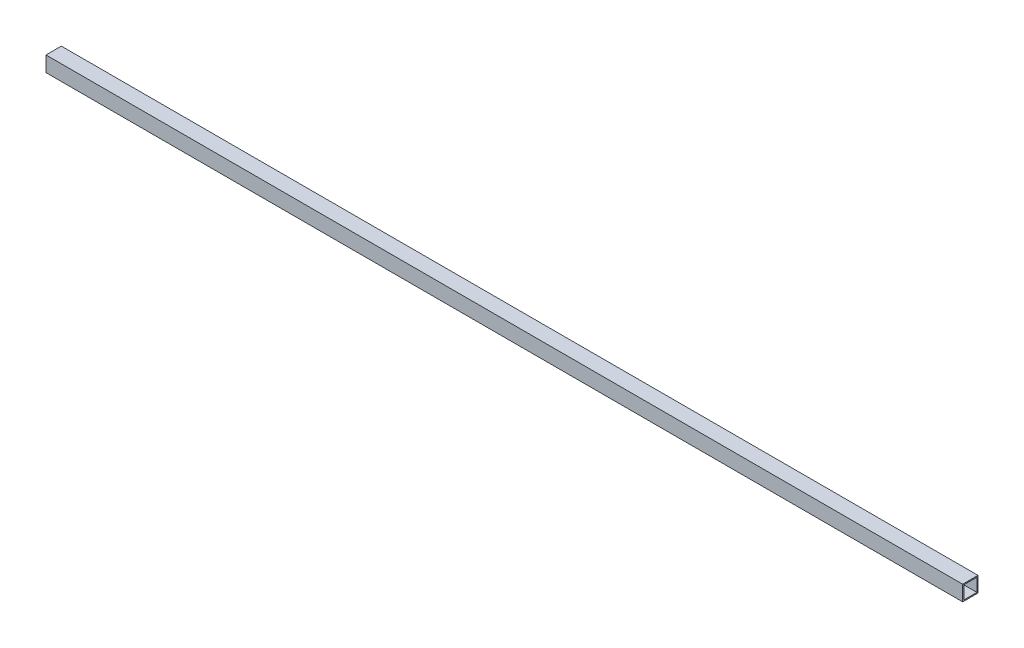
ISO-10303-21;
HEADER;
FILE_DESCRIPTION(('STEP AP214'),'2;1');
FILE_NAME('part.step','',(''),(''),'','','');
FILE_SCHEMA(('AUTOMOTIVE_DESIGN { 1 0 10303 214 1 1 1 1 }'));
ENDSEC;
DATA;
#1=APPLICATION_CONTEXT('core data for automotive mechanical design processes');
#2=APPLICATION_PROTOCOL_DEFINITION('international standard','automotive_design',2000,#1);
#3=PRODUCT_CONTEXT('',#1,'mechanical');
#4=PRODUCT('Part','Part','',(#3));
#5=PRODUCT_RELATED_PRODUCT_CATEGORY('part','',(#4));
#6=PRODUCT_DEFINITION_FORMATION('','',#4);
#7=PRODUCT_DEFINITION_CONTEXT('part definition',#1,'design');
#8=PRODUCT_DEFINITION('design','',#6,#7);
#9=PRODUCT_DEFINITION_SHAPE('','',#8);
#10=(LENGTH_UNIT() NAMED_UNIT(*) SI_UNIT(.MILLI.,.METRE.));
#11=(NAMED_UNIT(*) PLANE_ANGLE_UNIT() SI_UNIT($,.RADIAN.));
#12=(NAMED_UNIT(*) SI_UNIT($,.STERADIAN.) SOLID_ANGLE_UNIT());
#13=UNCERTAINTY_MEASURE_WITH_UNIT(LENGTH_MEASURE(1.E-05),#10,'distance_accuracy_value','');
#14=(GEOMETRIC_REPRESENTATION_CONTEXT(3) GLOBAL_UNCERTAINTY_ASSIGNED_CONTEXT((#13)) GLOBAL_UNIT_ASSIGNED_CONTEXT((#10,
#11,#12)) REPRESENTATION_CONTEXT('',''));
#15=CARTESIAN_POINT('',(0.,0.,0.));
#16=DIRECTION('',(0.,0.,1.));
#17=DIRECTION('',(1.,0.,0.));
#18=AXIS2_PLACEMENT_3D('',#15,#16,#17);
#19=CARTESIAN_POINT('',(2657.475,22.2250000000005,-22.225));
#20=DIRECTION('',(1.,0.,0.));
#21=DIRECTION('',(0.,1.,0.));
#22=AXIS2_PLACEMENT_3D('',#19,#20,#21);
#23=PLANE('',#22);
#24=DIRECTION('',(0.,1.,0.));
#25=VECTOR('',#24,1.);
#26=CARTESIAN_POINT('',(2657.475,22.2250000000005,0.));
#27=LINE('',#26,#25);
#28=CARTESIAN_POINT('',(2657.475,-1.94289029309402E-13,0.));
#29=VERTEX_POINT('',#28);
#30=CARTESIAN_POINT('',(2657.475,44.4500000000003,0.));
#31=VERTEX_POINT('',#30);
#32=EDGE_CURVE('E149',#29,#31,#27,.T.);
#33=ORIENTED_EDGE('',*,*,#32,.F.);
#34=DIRECTION('',(0.,0.,-1.));
#35=VECTOR('',#34,1.);
#36=CARTESIAN_POINT('',(2657.475,2.77555756156289E-13,-22.225));
#37=LINE('',#36,#35);
#38=CARTESIAN_POINT('',(2657.475,2.77555756156289E-13,-44.45));
#39=VERTEX_POINT('',#38);
#40=EDGE_CURVE('E153',#29,#39,#37,.T.);
#41=ORIENTED_EDGE('',*,*,#40,.T.);
#42=DIRECTION('',(0.,1.,0.));
#43=VECTOR('',#42,1.);
#44=CARTESIAN_POINT('',(2657.475,22.2250000000005,-44.45));
#45=LINE('',#44,#43);
#46=CARTESIAN_POINT('',(2657.475,44.4500000000004,-44.45));
#47=VERTEX_POINT('',#46);
#48=EDGE_CURVE('E157',#39,#47,#45,.T.);
#49=ORIENTED_EDGE('',*,*,#48,.T.);
#50=DIRECTION('',(0.,0.,-1.));
#51=VECTOR('',#50,1.);
#52=CARTESIAN_POINT('',(2657.475,44.4500000000005,-22.225));
#53=LINE('',#52,#51);
#54=EDGE_CURVE('E160',#31,#47,#53,.T.);
#55=ORIENTED_EDGE('',*,*,#54,.F.);
#56=EDGE_LOOP('',(#33,#41,#49,#55));
#57=FACE_BOUND('',#56,.T.);
#58=DIRECTION('',(0.,0.,-1.));
#59=VECTOR('',#58,1.);
#60=CARTESIAN_POINT('',(2657.475,3.17500000000029,-22.225));
#61=LINE('',#60,#59);
#62=CARTESIAN_POINT('',(2657.475,3.17500000000001,-3.17500000000004));
#63=VERTEX_POINT('',#62);
#64=CARTESIAN_POINT('',(2657.475,3.17500000000026,-41.275));
#65=VERTEX_POINT('',#64);
#66=EDGE_CURVE('E134',#63,#65,#61,.T.);
#67=ORIENTED_EDGE('',*,*,#66,.F.);
#68=DIRECTION('',(0.,1.,0.));
#69=VECTOR('',#68,1.);
#70=CARTESIAN_POINT('',(2657.475,22.2250000000005,-3.17500000000004));
#71=LINE('',#70,#69);
#72=CARTESIAN_POINT('',(2657.475,41.2750000000003,-3.17500000000004));
#73=VERTEX_POINT('',#72);
#74=EDGE_CURVE('E128',#63,#73,#71,.T.);
#75=ORIENTED_EDGE('',*,*,#74,.T.);
#76=DIRECTION('',(0.,0.,-1.));
#77=VECTOR('',#76,1.);
#78=CARTESIAN_POINT('',(2657.475,41.2750000000005,-22.225));
#79=LINE('',#78,#77);
#80=CARTESIAN_POINT('',(2657.475,41.2750000000004,-41.275));
#81=VERTEX_POINT('',#80);
#82=EDGE_CURVE('E110',#73,#81,#79,.T.);
#83=ORIENTED_EDGE('',*,*,#82,.T.);
#84=DIRECTION('',(0.,1.,0.));
#85=VECTOR('',#84,1.);
#86=CARTESIAN_POINT('',(2657.475,22.2250000000005,-41.275));
#87=LINE('',#86,#85);
#88=EDGE_CURVE('E144',#65,#81,#87,.T.);
#89=ORIENTED_EDGE('',*,*,#88,.F.);
#90=EDGE_LOOP('',(#67,#75,#83,#89));
#91=FACE_BOUND('',#90,.T.);
#92=ADVANCED_FACE('F16',(#57,#91),#23,.T.);
#93=CARTESIAN_POINT('',(0.,22.225,-22.225));
#94=DIRECTION('',(1.,0.,0.));
#95=DIRECTION('',(0.,1.,0.));
#96=AXIS2_PLACEMENT_3D('',#93,#94,#95);
#97=PLANE('',#96);
#98=DIRECTION('',(0.,1.,0.));
#99=VECTOR('',#98,1.);
#100=CARTESIAN_POINT('',(0.,22.225,0.));
#101=LINE('',#100,#99);
#102=CARTESIAN_POINT('',(0.,0.,0.));
#103=VERTEX_POINT('',#102);
#104=CARTESIAN_POINT('',(0.,44.4499999999996,0.));
#105=VERTEX_POINT('',#104);
#106=EDGE_CURVE('E165',#103,#105,#101,.T.);
#107=ORIENTED_EDGE('',*,*,#106,.T.);
#108=DIRECTION('',(0.,0.,-1.));
#109=VECTOR('',#108,1.);
#110=CARTESIAN_POINT('',(0.,44.4499999999999,-22.225));
#111=LINE('',#110,#109);
#112=CARTESIAN_POINT('',(0.,44.45,-44.45));
#113=VERTEX_POINT('',#112);
#114=EDGE_CURVE('E154',#105,#113,#111,.T.);
#115=ORIENTED_EDGE('',*,*,#114,.T.);
#116=DIRECTION('',(0.,1.,0.));
#117=VECTOR('',#116,1.);
#118=CARTESIAN_POINT('',(0.,22.225,-44.45));
#119=LINE('',#118,#117);
#120=CARTESIAN_POINT('',(0.,0.,-44.45));
#121=VERTEX_POINT('',#120);
#122=EDGE_CURVE('E172',#121,#113,#119,.T.);
#123=ORIENTED_EDGE('',*,*,#122,.F.);
#124=DIRECTION('',(0.,0.,-1.));
#125=VECTOR('',#124,1.);
#126=CARTESIAN_POINT('',(0.,0.,-22.225));
#127=LINE('',#126,#125);
#128=EDGE_CURVE('E169',#103,#121,#127,.T.);
#129=ORIENTED_EDGE('',*,*,#128,.F.);
#130=EDGE_LOOP('',(#107,#115,#123,#129));
#131=FACE_BOUND('',#130,.T.);
#132=DIRECTION('',(0.,1.,0.));
#133=VECTOR('',#132,1.);
#134=CARTESIAN_POINT('',(0.,22.225,-3.17499999999998));
#135=LINE('',#134,#133);
#136=CARTESIAN_POINT('',(0.,3.17500000000001,-3.17499999999998));
#137=VERTEX_POINT('',#136);
#138=CARTESIAN_POINT('',(0.,41.2749999999996,-3.17499999999998));
#139=VERTEX_POINT('',#138);
#140=EDGE_CURVE('E117',#137,#139,#135,.T.);
#141=ORIENTED_EDGE('',*,*,#140,.F.);
#142=DIRECTION('',(0.,0.,-1.));
#143=VECTOR('',#142,1.);
#144=CARTESIAN_POINT('',(0.,3.17500000000001,-22.225));
#145=LINE('',#144,#143);
#146=CARTESIAN_POINT('',(0.,3.17500000000001,-41.275));
#147=VERTEX_POINT('',#146);
#148=EDGE_CURVE('E124',#137,#147,#145,.T.);
#149=ORIENTED_EDGE('',*,*,#148,.T.);
#150=DIRECTION('',(0.,1.,0.));
#151=VECTOR('',#150,1.);
#152=CARTESIAN_POINT('',(0.,22.225,-41.275));
#153=LINE('',#152,#151);
#154=CARTESIAN_POINT('',(0.,41.275,-41.275));
#155=VERTEX_POINT('',#154);
#156=EDGE_CURVE('E49',#147,#155,#153,.T.);
#157=ORIENTED_EDGE('',*,*,#156,.T.);
#158=DIRECTION('',(0.,0.,-1.));
#159=VECTOR('',#158,1.);
#160=CARTESIAN_POINT('',(0.,41.2749999999999,-22.225));
#161=LINE('',#160,#159);
#162=EDGE_CURVE('E108',#139,#155,#161,.T.);
#163=ORIENTED_EDGE('',*,*,#162,.F.);
#164=EDGE_LOOP('',(#141,#149,#157,#163));
#165=FACE_BOUND('',#164,.T.);
#166=ADVANCED_FACE('F126',(#131,#165),#97,.F.);
#167=CARTESIAN_POINT('',(2657.475,22.2250000000005,0.));
#168=DIRECTION('',(0.,0.,1.));
#169=DIRECTION('',(1.,0.,0.));
#170=AXIS2_PLACEMENT_3D('',#167,#168,#169);
#171=PLANE('',#170);
#172=ORIENTED_EDGE('',*,*,#106,.F.);
#173=DIRECTION('',(-1.,0.,0.));
#174=VECTOR('',#173,1.);
#175=CARTESIAN_POINT('',(2657.475,-1.94289029309402E-13,0.));
#176=LINE('',#175,#174);
#177=EDGE_CURVE('E11',#29,#103,#176,.T.);
#178=ORIENTED_EDGE('',*,*,#177,.F.);
#179=ORIENTED_EDGE('',*,*,#32,.T.);
#180=DIRECTION('',(-1.,0.,0.));
#181=VECTOR('',#180,1.);
#182=CARTESIAN_POINT('',(2657.475,44.4500000000003,0.));
#183=LINE('',#182,#181);
#184=EDGE_CURVE('E164',#31,#105,#183,.T.);
#185=ORIENTED_EDGE('',*,*,#184,.T.);
#186=EDGE_LOOP('',(#172,#178,#179,#185));
#187=FACE_BOUND('',#186,.T.);
#188=ADVANCED_FACE('F18',(#187),#171,.T.);
#189=CARTESIAN_POINT('',(2657.475,2.77555756156289E-13,-22.225));
#190=DIRECTION('',(0.,1.,0.));
#191=DIRECTION('',(0.,0.,1.));
#192=AXIS2_PLACEMENT_3D('',#189,#190,#191);
#193=PLANE('',#192);
#194=ORIENTED_EDGE('',*,*,#128,.T.);
#195=DIRECTION('',(-1.,0.,0.));
#196=VECTOR('',#195,1.);
#197=CARTESIAN_POINT('',(2657.475,2.77555756156289E-13,-44.45));
#198=LINE('',#197,#196);
#199=EDGE_CURVE('E25',#39,#121,#198,.T.);
#200=ORIENTED_EDGE('',*,*,#199,.F.);
#201=ORIENTED_EDGE('',*,*,#40,.F.);
#202=ORIENTED_EDGE('',*,*,#177,.T.);
#203=EDGE_LOOP('',(#194,#200,#201,#202));
#204=FACE_BOUND('',#203,.T.);
#205=ADVANCED_FACE('F206',(#204),#193,.F.);
#206=CARTESIAN_POINT('',(2657.475,22.2250000000005,-44.45));
#207=DIRECTION('',(0.,0.,1.));
#208=DIRECTION('',(1.,0.,0.));
#209=AXIS2_PLACEMENT_3D('',#206,#207,#208);
#210=PLANE('',#209);
#211=ORIENTED_EDGE('',*,*,#122,.T.);
#212=DIRECTION('',(-1.,0.,0.));
#213=VECTOR('',#212,1.);
#214=CARTESIAN_POINT('',(2657.475,44.4500000000004,-44.45));
#215=LINE('',#214,#213);
#216=EDGE_CURVE('E181',#47,#113,#215,.T.);
#217=ORIENTED_EDGE('',*,*,#216,.F.);
#218=ORIENTED_EDGE('',*,*,#48,.F.);
#219=ORIENTED_EDGE('',*,*,#199,.T.);
#220=EDGE_LOOP('',(#211,#217,#218,#219));
#221=FACE_BOUND('',#220,.T.);
#222=ADVANCED_FACE('F192',(#221),#210,.F.);
#223=CARTESIAN_POINT('',(2657.475,44.4500000000005,-22.225));
#224=DIRECTION('',(0.,1.,0.));
#225=DIRECTION('',(0.,0.,1.));
#226=AXIS2_PLACEMENT_3D('',#223,#224,#225);
#227=PLANE('',#226);
#228=ORIENTED_EDGE('',*,*,#114,.F.);
#229=ORIENTED_EDGE('',*,*,#184,.F.);
#230=ORIENTED_EDGE('',*,*,#54,.T.);
#231=ORIENTED_EDGE('',*,*,#216,.T.);
#232=EDGE_LOOP('',(#228,#229,#230,#231));
#233=FACE_BOUND('',#232,.T.);
#234=ADVANCED_FACE('F201',(#233),#227,.T.);
#235=CARTESIAN_POINT('',(2657.475,22.2250000000005,-3.17500000000004));
#236=DIRECTION('',(0.,0.,1.));
#237=DIRECTION('',(1.,0.,0.));
#238=AXIS2_PLACEMENT_3D('',#235,#236,#237);
#239=PLANE('',#238);
#240=ORIENTED_EDGE('',*,*,#140,.T.);
#241=DIRECTION('',(-1.,0.,0.));
#242=VECTOR('',#241,1.);
#243=CARTESIAN_POINT('',(2657.475,41.2750000000003,-3.17500000000004));
#244=LINE('',#243,#242);
#245=EDGE_CURVE('E104',#73,#139,#244,.T.);
#246=ORIENTED_EDGE('',*,*,#245,.F.);
#247=ORIENTED_EDGE('',*,*,#74,.F.);
#248=DIRECTION('',(-1.,0.,0.));
#249=VECTOR('',#248,1.);
#250=CARTESIAN_POINT('',(2657.475,3.17500000000001,-3.17500000000004));
#251=LINE('',#250,#249);
#252=EDGE_CURVE('E119',#63,#137,#251,.T.);
#253=ORIENTED_EDGE('',*,*,#252,.T.);
#254=EDGE_LOOP('',(#240,#246,#247,#253));
#255=FACE_BOUND('',#254,.T.);
#256=ADVANCED_FACE('F118',(#255),#239,.F.);
#257=CARTESIAN_POINT('',(2657.475,3.17500000000029,-22.225));
#258=DIRECTION('',(0.,1.,0.));
#259=DIRECTION('',(0.,0.,1.));
#260=AXIS2_PLACEMENT_3D('',#257,#258,#259);
#261=PLANE('',#260);
#262=ORIENTED_EDGE('',*,*,#148,.F.);
#263=ORIENTED_EDGE('',*,*,#252,.F.);
#264=ORIENTED_EDGE('',*,*,#66,.T.);
#265=DIRECTION('',(-1.,0.,0.));
#266=VECTOR('',#265,1.);
#267=CARTESIAN_POINT('',(2657.475,3.17500000000026,-41.275));
#268=LINE('',#267,#266);
#269=EDGE_CURVE('E362',#65,#147,#268,.T.);
#270=ORIENTED_EDGE('',*,*,#269,.T.);
#271=EDGE_LOOP('',(#262,#263,#264,#270));
#272=FACE_BOUND('',#271,.T.);
#273=ADVANCED_FACE('F242',(#272),#261,.T.);
#274=CARTESIAN_POINT('',(2657.475,22.2250000000005,-41.275));
#275=DIRECTION('',(0.,0.,1.));
#276=DIRECTION('',(1.,0.,0.));
#277=AXIS2_PLACEMENT_3D('',#274,#275,#276);
#278=PLANE('',#277);
#279=ORIENTED_EDGE('',*,*,#156,.F.);
#280=ORIENTED_EDGE('',*,*,#269,.F.);
#281=ORIENTED_EDGE('',*,*,#88,.T.);
#282=DIRECTION('',(-1.,0.,0.));
#283=VECTOR('',#282,1.);
#284=CARTESIAN_POINT('',(2657.475,41.2750000000004,-41.275));
#285=LINE('',#284,#283);
#286=EDGE_CURVE('E37',#81,#155,#285,.T.);
#287=ORIENTED_EDGE('',*,*,#286,.T.);
#288=EDGE_LOOP('',(#279,#280,#281,#287));
#289=FACE_BOUND('',#288,.T.);
#290=ADVANCED_FACE('F249',(#289),#278,.T.);
#291=CARTESIAN_POINT('',(2657.475,41.2750000000005,-22.225));
#292=DIRECTION('',(0.,1.,0.));
#293=DIRECTION('',(0.,0.,1.));
#294=AXIS2_PLACEMENT_3D('',#291,#292,#293);
#295=PLANE('',#294);
#296=ORIENTED_EDGE('',*,*,#162,.T.);
#297=ORIENTED_EDGE('',*,*,#286,.F.);
#298=ORIENTED_EDGE('',*,*,#82,.F.);
#299=ORIENTED_EDGE('',*,*,#245,.T.);
#300=EDGE_LOOP('',(#296,#297,#298,#299));
#301=FACE_BOUND('',#300,.T.);
#302=ADVANCED_FACE('F106',(#301),#295,.F.);
#303=CLOSED_SHELL('',(#92,#166,#188,#205,#222,#234,#256,#273,#290,#302));
#304=MANIFOLD_SOLID_BREP('B1',#303);
#305=ADVANCED_BREP_SHAPE_REPRESENTATION('',(#18,#304),#14);
#306=SHAPE_DEFINITION_REPRESENTATION(#9,#305);
ENDSEC;
END-ISO-10303-21;
